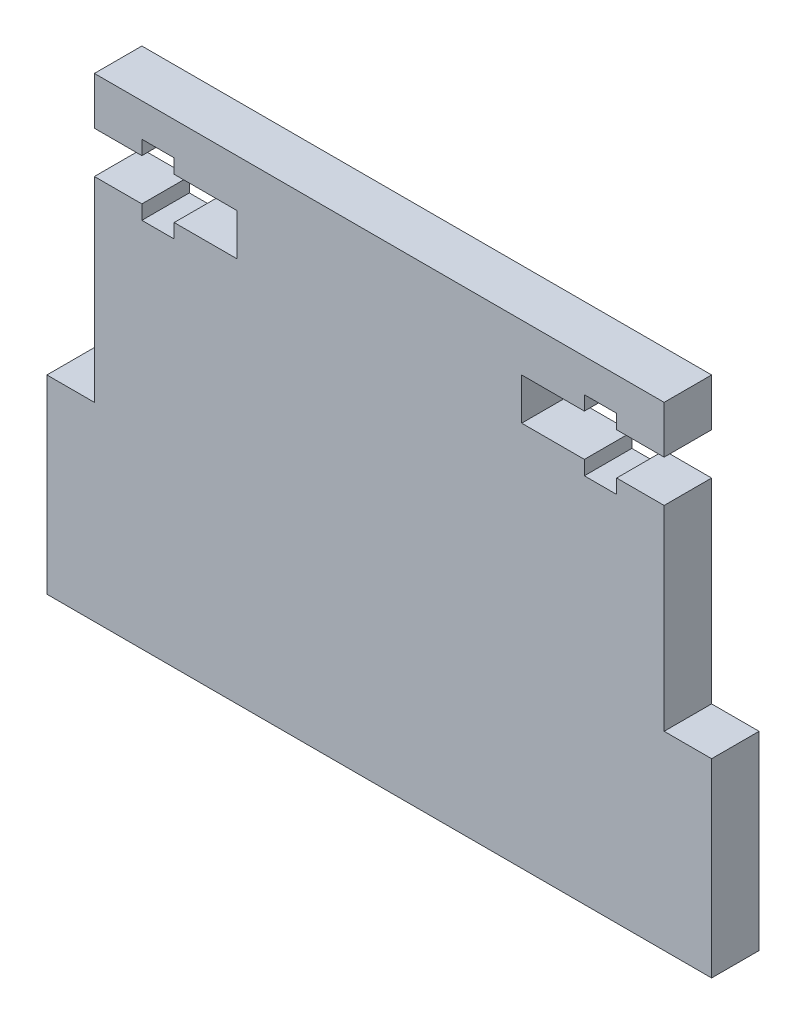
ISO-10303-21;
HEADER;
FILE_DESCRIPTION(('STEP AP214'),'2;1');
FILE_NAME('part.step','',(''),(''),'','','');
FILE_SCHEMA(('AUTOMOTIVE_DESIGN { 1 0 10303 214 1 1 1 1 }'));
ENDSEC;
DATA;
#1=APPLICATION_CONTEXT('core data for automotive mechanical design processes');
#2=APPLICATION_PROTOCOL_DEFINITION('international standard','automotive_design',2000,#1);
#3=PRODUCT_CONTEXT('',#1,'mechanical');
#4=PRODUCT('Part','Part','',(#3));
#5=PRODUCT_RELATED_PRODUCT_CATEGORY('part','',(#4));
#6=PRODUCT_DEFINITION_FORMATION('','',#4);
#7=PRODUCT_DEFINITION_CONTEXT('part definition',#1,'design');
#8=PRODUCT_DEFINITION('design','',#6,#7);
#9=PRODUCT_DEFINITION_SHAPE('','',#8);
#10=(LENGTH_UNIT() NAMED_UNIT(*) SI_UNIT(.MILLI.,.METRE.));
#11=(NAMED_UNIT(*) PLANE_ANGLE_UNIT() SI_UNIT($,.RADIAN.));
#12=(NAMED_UNIT(*) SI_UNIT($,.STERADIAN.) SOLID_ANGLE_UNIT());
#13=UNCERTAINTY_MEASURE_WITH_UNIT(LENGTH_MEASURE(1.E-05),#10,'distance_accuracy_value','');
#14=(GEOMETRIC_REPRESENTATION_CONTEXT(3) GLOBAL_UNCERTAINTY_ASSIGNED_CONTEXT((#13)) GLOBAL_UNIT_ASSIGNED_CONTEXT((#10,
#11,#12)) REPRESENTATION_CONTEXT('',''));
#15=CARTESIAN_POINT('',(0.,0.,0.));
#16=DIRECTION('',(0.,0.,1.));
#17=DIRECTION('',(1.,0.,0.));
#18=AXIS2_PLACEMENT_3D('',#15,#16,#17);
#19=CARTESIAN_POINT('',(-30.,25.,5.));
#20=DIRECTION('',(1.,0.,0.));
#21=DIRECTION('',(0.,1.,0.));
#22=AXIS2_PLACEMENT_3D('',#19,#20,#21);
#23=PLANE('',#22);
#24=DIRECTION('',(0.,-1.,0.));
#25=VECTOR('',#24,1.);
#26=CARTESIAN_POINT('',(-30.,25.,0.));
#27=LINE('',#26,#25);
#28=CARTESIAN_POINT('',(-30.,15.6,0.));
#29=VERTEX_POINT('',#28);
#30=CARTESIAN_POINT('',(-30.,-5.,0.));
#31=VERTEX_POINT('',#30);
#32=EDGE_CURVE('E53',#29,#31,#27,.T.);
#33=ORIENTED_EDGE('',*,*,#32,.T.);
#34=DIRECTION('',(0.,0.,-1.));
#35=VECTOR('',#34,1.);
#36=CARTESIAN_POINT('',(-30.,-5.,5.));
#37=LINE('',#36,#35);
#38=CARTESIAN_POINT('',(-30.,-5.,5.));
#39=VERTEX_POINT('',#38);
#40=EDGE_CURVE('E48',#39,#31,#37,.T.);
#41=ORIENTED_EDGE('',*,*,#40,.F.);
#42=DIRECTION('',(0.,-1.,0.));
#43=VECTOR('',#42,1.);
#44=CARTESIAN_POINT('',(-30.,25.,5.));
#45=LINE('',#44,#43);
#46=CARTESIAN_POINT('',(-30.,15.6,5.));
#47=VERTEX_POINT('',#46);
#48=EDGE_CURVE('E477',#47,#39,#45,.T.);
#49=ORIENTED_EDGE('',*,*,#48,.F.);
#50=DIRECTION('',(0.,0.,1.));
#51=VECTOR('',#50,1.);
#52=CARTESIAN_POINT('',(-30.,15.6,0.));
#53=LINE('',#52,#51);
#54=EDGE_CURVE('E363',#29,#47,#53,.T.);
#55=ORIENTED_EDGE('',*,*,#54,.F.);
#56=EDGE_LOOP('',(#33,#41,#49,#55));
#57=FACE_BOUND('',#56,.T.);
#58=ADVANCED_FACE('F33',(#57),#23,.F.);
#59=CARTESIAN_POINT('',(30.,25.,5.));
#60=DIRECTION('',(-1.,0.,0.));
#61=DIRECTION('',(0.,-1.,0.));
#62=AXIS2_PLACEMENT_3D('',#59,#60,#61);
#63=PLANE('',#62);
#64=DIRECTION('',(0.,1.,0.));
#65=VECTOR('',#64,1.);
#66=CARTESIAN_POINT('',(30.,25.,5.));
#67=LINE('',#66,#65);
#68=CARTESIAN_POINT('',(30.,-5.,5.));
#69=VERTEX_POINT('',#68);
#70=CARTESIAN_POINT('',(30.,15.6,5.));
#71=VERTEX_POINT('',#70);
#72=EDGE_CURVE('E479',#69,#71,#67,.T.);
#73=ORIENTED_EDGE('',*,*,#72,.F.);
#74=DIRECTION('',(0.,0.,-1.));
#75=VECTOR('',#74,1.);
#76=CARTESIAN_POINT('',(30.,-5.,5.));
#77=LINE('',#76,#75);
#78=CARTESIAN_POINT('',(30.,-5.,0.));
#79=VERTEX_POINT('',#78);
#80=EDGE_CURVE('E285',#69,#79,#77,.T.);
#81=ORIENTED_EDGE('',*,*,#80,.T.);
#82=DIRECTION('',(0.,1.,0.));
#83=VECTOR('',#82,1.);
#84=CARTESIAN_POINT('',(30.,25.,0.));
#85=LINE('',#84,#83);
#86=CARTESIAN_POINT('',(30.,15.6,0.));
#87=VERTEX_POINT('',#86);
#88=EDGE_CURVE('E489',#79,#87,#85,.T.);
#89=ORIENTED_EDGE('',*,*,#88,.T.);
#90=DIRECTION('',(0.,0.,1.));
#91=VECTOR('',#90,1.);
#92=CARTESIAN_POINT('',(30.,15.6,0.));
#93=LINE('',#92,#91);
#94=EDGE_CURVE('E335',#87,#71,#93,.T.);
#95=ORIENTED_EDGE('',*,*,#94,.T.);
#96=EDGE_LOOP('',(#73,#81,#89,#95));
#97=FACE_BOUND('',#96,.T.);
#98=ADVANCED_FACE('F560',(#97),#63,.F.);
#99=CARTESIAN_POINT('',(-30.,25.,0.));
#100=VERTEX_POINT('',#99);
#101=CARTESIAN_POINT('',(-30.,20.,0.));
#102=VERTEX_POINT('',#101);
#103=EDGE_CURVE('E483',#100,#102,#27,.T.);
#104=ORIENTED_EDGE('',*,*,#103,.T.);
#105=DIRECTION('',(0.,0.,1.));
#106=VECTOR('',#105,1.);
#107=CARTESIAN_POINT('',(-30.,20.,0.));
#108=LINE('',#107,#106);
#109=CARTESIAN_POINT('',(-30.,20.,5.));
#110=VERTEX_POINT('',#109);
#111=EDGE_CURVE('E365',#102,#110,#108,.T.);
#112=ORIENTED_EDGE('',*,*,#111,.T.);
#113=CARTESIAN_POINT('',(-30.,25.,5.));
#114=VERTEX_POINT('',#113);
#115=EDGE_CURVE('E254',#114,#110,#45,.T.);
#116=ORIENTED_EDGE('',*,*,#115,.F.);
#117=DIRECTION('',(0.,0.,-1.));
#118=VECTOR('',#117,1.);
#119=CARTESIAN_POINT('',(-30.,25.,5.));
#120=LINE('',#119,#118);
#121=EDGE_CURVE('E41',#114,#100,#120,.T.);
#122=ORIENTED_EDGE('',*,*,#121,.T.);
#123=EDGE_LOOP('',(#104,#112,#116,#122));
#124=FACE_BOUND('',#123,.T.);
#125=ADVANCED_FACE('F35',(#124),#23,.F.);
#126=CARTESIAN_POINT('',(-30.,-25.,5.));
#127=DIRECTION('',(0.,1.,0.));
#128=DIRECTION('',(0.,0.,1.));
#129=AXIS2_PLACEMENT_3D('',#126,#127,#128);
#130=PLANE('',#129);
#131=DIRECTION('',(1.,0.,0.));
#132=VECTOR('',#131,1.);
#133=CARTESIAN_POINT('',(-30.,-25.,0.));
#134=LINE('',#133,#132);
#135=CARTESIAN_POINT('',(-35.,-25.,0.));
#136=VERTEX_POINT('',#135);
#137=CARTESIAN_POINT('',(35.,-25.,0.));
#138=VERTEX_POINT('',#137);
#139=EDGE_CURVE('E486',#136,#138,#134,.T.);
#140=ORIENTED_EDGE('',*,*,#139,.T.);
#141=DIRECTION('',(0.,0.,-1.));
#142=VECTOR('',#141,1.);
#143=CARTESIAN_POINT('',(35.,-25.,5.));
#144=LINE('',#143,#142);
#145=CARTESIAN_POINT('',(35.,-25.,5.));
#146=VERTEX_POINT('',#145);
#147=EDGE_CURVE('E248',#146,#138,#144,.T.);
#148=ORIENTED_EDGE('',*,*,#147,.F.);
#149=DIRECTION('',(1.,0.,0.));
#150=VECTOR('',#149,1.);
#151=CARTESIAN_POINT('',(-30.,-25.,5.));
#152=LINE('',#151,#150);
#153=CARTESIAN_POINT('',(-35.,-25.,5.));
#154=VERTEX_POINT('',#153);
#155=EDGE_CURVE('E242',#154,#146,#152,.T.);
#156=ORIENTED_EDGE('',*,*,#155,.F.);
#157=DIRECTION('',(0.,0.,-1.));
#158=VECTOR('',#157,1.);
#159=CARTESIAN_POINT('',(-35.,-25.,5.));
#160=LINE('',#159,#158);
#161=EDGE_CURVE('E245',#154,#136,#160,.T.);
#162=ORIENTED_EDGE('',*,*,#161,.T.);
#163=EDGE_LOOP('',(#140,#148,#156,#162));
#164=FACE_BOUND('',#163,.T.);
#165=ADVANCED_FACE('F244',(#164),#130,.F.);
#166=CARTESIAN_POINT('',(30.,20.,5.));
#167=VERTEX_POINT('',#166);
#168=CARTESIAN_POINT('',(30.,25.,5.));
#169=VERTEX_POINT('',#168);
#170=EDGE_CURVE('E253',#167,#169,#67,.T.);
#171=ORIENTED_EDGE('',*,*,#170,.F.);
#172=DIRECTION('',(0.,0.,1.));
#173=VECTOR('',#172,1.);
#174=CARTESIAN_POINT('',(30.,20.,0.));
#175=LINE('',#174,#173);
#176=CARTESIAN_POINT('',(30.,20.,0.));
#177=VERTEX_POINT('',#176);
#178=EDGE_CURVE('E421',#177,#167,#175,.T.);
#179=ORIENTED_EDGE('',*,*,#178,.F.);
#180=CARTESIAN_POINT('',(30.,25.,0.));
#181=VERTEX_POINT('',#180);
#182=EDGE_CURVE('E488',#177,#181,#85,.T.);
#183=ORIENTED_EDGE('',*,*,#182,.T.);
#184=DIRECTION('',(0.,0.,-1.));
#185=VECTOR('',#184,1.);
#186=CARTESIAN_POINT('',(30.,25.,5.));
#187=LINE('',#186,#185);
#188=EDGE_CURVE('E11',#169,#181,#187,.T.);
#189=ORIENTED_EDGE('',*,*,#188,.F.);
#190=EDGE_LOOP('',(#171,#179,#183,#189));
#191=FACE_BOUND('',#190,.T.);
#192=ADVANCED_FACE('F514',(#191),#63,.F.);
#193=CARTESIAN_POINT('',(-30.,25.,5.));
#194=DIRECTION('',(0.,-1.,0.));
#195=DIRECTION('',(0.,0.,-1.));
#196=AXIS2_PLACEMENT_3D('',#193,#194,#195);
#197=PLANE('',#196);
#198=DIRECTION('',(-1.,0.,0.));
#199=VECTOR('',#198,1.);
#200=CARTESIAN_POINT('',(-30.,25.,0.));
#201=LINE('',#200,#199);
#202=EDGE_CURVE('E491',#181,#100,#201,.T.);
#203=ORIENTED_EDGE('',*,*,#202,.T.);
#204=ORIENTED_EDGE('',*,*,#121,.F.);
#205=DIRECTION('',(-1.,0.,0.));
#206=VECTOR('',#205,1.);
#207=CARTESIAN_POINT('',(-30.,25.,5.));
#208=LINE('',#207,#206);
#209=EDGE_CURVE('E481',#169,#114,#208,.T.);
#210=ORIENTED_EDGE('',*,*,#209,.F.);
#211=ORIENTED_EDGE('',*,*,#188,.T.);
#212=EDGE_LOOP('',(#203,#204,#210,#211));
#213=FACE_BOUND('',#212,.T.);
#214=ADVANCED_FACE('F512',(#213),#197,.F.);
#215=CARTESIAN_POINT('',(0.,0.,5.));
#216=DIRECTION('',(0.,0.,1.));
#217=DIRECTION('',(1.,0.,0.));
#218=AXIS2_PLACEMENT_3D('',#215,#216,#217);
#219=PLANE('',#218);
#220=DIRECTION('',(1.,0.,0.));
#221=VECTOR('',#220,1.);
#222=CARTESIAN_POINT('',(-25.,15.6,5.));
#223=LINE('',#222,#221);
#224=CARTESIAN_POINT('',(-25.,15.6,5.));
#225=VERTEX_POINT('',#224);
#226=EDGE_CURVE('E331',#47,#225,#223,.T.);
#227=ORIENTED_EDGE('',*,*,#226,.F.);
#228=ORIENTED_EDGE('',*,*,#48,.T.);
#229=DIRECTION('',(1.,0.,0.));
#230=VECTOR('',#229,1.);
#231=CARTESIAN_POINT('',(-30.,-5.,5.));
#232=LINE('',#231,#230);
#233=CARTESIAN_POINT('',(-35.,-5.,5.));
#234=VERTEX_POINT('',#233);
#235=EDGE_CURVE('E264',#234,#39,#232,.T.);
#236=ORIENTED_EDGE('',*,*,#235,.F.);
#237=DIRECTION('',(0.,1.,0.));
#238=VECTOR('',#237,1.);
#239=CARTESIAN_POINT('',(-35.,-25.,5.));
#240=LINE('',#239,#238);
#241=EDGE_CURVE('E259',#154,#234,#240,.T.);
#242=ORIENTED_EDGE('',*,*,#241,.F.);
#243=ORIENTED_EDGE('',*,*,#155,.T.);
#244=DIRECTION('',(0.,-1.,0.));
#245=VECTOR('',#244,1.);
#246=CARTESIAN_POINT('',(35.,-25.,5.));
#247=LINE('',#246,#245);
#248=CARTESIAN_POINT('',(35.,-5.,5.));
#249=VERTEX_POINT('',#248);
#250=EDGE_CURVE('E282',#249,#146,#247,.T.);
#251=ORIENTED_EDGE('',*,*,#250,.F.);
#252=DIRECTION('',(1.,0.,0.));
#253=VECTOR('',#252,1.);
#254=CARTESIAN_POINT('',(30.,-5.,5.));
#255=LINE('',#254,#253);
#256=EDGE_CURVE('E279',#69,#249,#255,.T.);
#257=ORIENTED_EDGE('',*,*,#256,.F.);
#258=ORIENTED_EDGE('',*,*,#72,.T.);
#259=DIRECTION('',(1.,0.,0.));
#260=VECTOR('',#259,1.);
#261=CARTESIAN_POINT('',(25.,15.6,5.));
#262=LINE('',#261,#260);
#263=CARTESIAN_POINT('',(25.,15.6,5.));
#264=VERTEX_POINT('',#263);
#265=EDGE_CURVE('E391',#264,#71,#262,.T.);
#266=ORIENTED_EDGE('',*,*,#265,.F.);
#267=DIRECTION('',(0.,1.,0.));
#268=VECTOR('',#267,1.);
#269=CARTESIAN_POINT('',(25.,14.1,5.));
#270=LINE('',#269,#268);
#271=CARTESIAN_POINT('',(25.,14.1,5.));
#272=VERTEX_POINT('',#271);
#273=EDGE_CURVE('E448',#272,#264,#270,.T.);
#274=ORIENTED_EDGE('',*,*,#273,.F.);
#275=DIRECTION('',(1.,0.,0.));
#276=VECTOR('',#275,1.);
#277=CARTESIAN_POINT('',(21.6,14.1,5.));
#278=LINE('',#277,#276);
#279=CARTESIAN_POINT('',(21.6,14.1,5.));
#280=VERTEX_POINT('',#279);
#281=EDGE_CURVE('E445',#280,#272,#278,.T.);
#282=ORIENTED_EDGE('',*,*,#281,.F.);
#283=DIRECTION('',(0.,-1.,0.));
#284=VECTOR('',#283,1.);
#285=CARTESIAN_POINT('',(21.6,15.6,5.));
#286=LINE('',#285,#284);
#287=CARTESIAN_POINT('',(21.6,15.6,5.));
#288=VERTEX_POINT('',#287);
#289=EDGE_CURVE('E442',#288,#280,#286,.T.);
#290=ORIENTED_EDGE('',*,*,#289,.F.);
#291=DIRECTION('',(1.,0.,0.));
#292=VECTOR('',#291,1.);
#293=CARTESIAN_POINT('',(15.,15.6,5.));
#294=LINE('',#293,#292);
#295=CARTESIAN_POINT('',(15.,15.6,5.));
#296=VERTEX_POINT('',#295);
#297=EDGE_CURVE('E439',#296,#288,#294,.T.);
#298=ORIENTED_EDGE('',*,*,#297,.F.);
#299=DIRECTION('',(0.,-1.,0.));
#300=VECTOR('',#299,1.);
#301=CARTESIAN_POINT('',(15.,20.,5.));
#302=LINE('',#301,#300);
#303=CARTESIAN_POINT('',(15.,20.,5.));
#304=VERTEX_POINT('',#303);
#305=EDGE_CURVE('E436',#304,#296,#302,.T.);
#306=ORIENTED_EDGE('',*,*,#305,.F.);
#307=DIRECTION('',(-1.,0.,0.));
#308=VECTOR('',#307,1.);
#309=CARTESIAN_POINT('',(21.6,20.,5.));
#310=LINE('',#309,#308);
#311=CARTESIAN_POINT('',(21.6,20.,5.));
#312=VERTEX_POINT('',#311);
#313=EDGE_CURVE('E433',#312,#304,#310,.T.);
#314=ORIENTED_EDGE('',*,*,#313,.F.);
#315=DIRECTION('',(0.,-1.,0.));
#316=VECTOR('',#315,1.);
#317=CARTESIAN_POINT('',(21.6,21.5,5.));
#318=LINE('',#317,#316);
#319=CARTESIAN_POINT('',(21.6,21.5,5.));
#320=VERTEX_POINT('',#319);
#321=EDGE_CURVE('E430',#320,#312,#318,.T.);
#322=ORIENTED_EDGE('',*,*,#321,.F.);
#323=DIRECTION('',(-1.,0.,0.));
#324=VECTOR('',#323,1.);
#325=CARTESIAN_POINT('',(25.,21.5,5.));
#326=LINE('',#325,#324);
#327=CARTESIAN_POINT('',(25.,21.5,5.));
#328=VERTEX_POINT('',#327);
#329=EDGE_CURVE('E427',#328,#320,#326,.T.);
#330=ORIENTED_EDGE('',*,*,#329,.F.);
#331=DIRECTION('',(0.,1.,0.));
#332=VECTOR('',#331,1.);
#333=CARTESIAN_POINT('',(25.,20.,5.));
#334=LINE('',#333,#332);
#335=CARTESIAN_POINT('',(25.,20.,5.));
#336=VERTEX_POINT('',#335);
#337=EDGE_CURVE('E424',#336,#328,#334,.T.);
#338=ORIENTED_EDGE('',*,*,#337,.F.);
#339=DIRECTION('',(-1.,0.,0.));
#340=VECTOR('',#339,1.);
#341=CARTESIAN_POINT('',(30.,20.,5.));
#342=LINE('',#341,#340);
#343=EDGE_CURVE('E291',#167,#336,#342,.T.);
#344=ORIENTED_EDGE('',*,*,#343,.F.);
#345=ORIENTED_EDGE('',*,*,#170,.T.);
#346=ORIENTED_EDGE('',*,*,#209,.T.);
#347=ORIENTED_EDGE('',*,*,#115,.T.);
#348=DIRECTION('',(-1.,0.,0.));
#349=VECTOR('',#348,1.);
#350=CARTESIAN_POINT('',(-30.,20.,5.));
#351=LINE('',#350,#349);
#352=CARTESIAN_POINT('',(-25.,20.,5.));
#353=VERTEX_POINT('',#352);
#354=EDGE_CURVE('E300',#353,#110,#351,.T.);
#355=ORIENTED_EDGE('',*,*,#354,.F.);
#356=DIRECTION('',(0.,-1.,0.));
#357=VECTOR('',#356,1.);
#358=CARTESIAN_POINT('',(-25.,20.,5.));
#359=LINE('',#358,#357);
#360=CARTESIAN_POINT('',(-25.,21.5,5.));
#361=VERTEX_POINT('',#360);
#362=EDGE_CURVE('E359',#361,#353,#359,.T.);
#363=ORIENTED_EDGE('',*,*,#362,.F.);
#364=DIRECTION('',(-1.,0.,0.));
#365=VECTOR('',#364,1.);
#366=CARTESIAN_POINT('',(-25.,21.5,5.));
#367=LINE('',#366,#365);
#368=CARTESIAN_POINT('',(-21.6,21.5,5.));
#369=VERTEX_POINT('',#368);
#370=EDGE_CURVE('E356',#369,#361,#367,.T.);
#371=ORIENTED_EDGE('',*,*,#370,.F.);
#372=DIRECTION('',(0.,1.,0.));
#373=VECTOR('',#372,1.);
#374=CARTESIAN_POINT('',(-21.6,21.5,5.));
#375=LINE('',#374,#373);
#376=CARTESIAN_POINT('',(-21.6,20.,5.));
#377=VERTEX_POINT('',#376);
#378=EDGE_CURVE('E353',#377,#369,#375,.T.);
#379=ORIENTED_EDGE('',*,*,#378,.F.);
#380=DIRECTION('',(-1.,0.,0.));
#381=VECTOR('',#380,1.);
#382=CARTESIAN_POINT('',(-21.6,20.,5.));
#383=LINE('',#382,#381);
#384=CARTESIAN_POINT('',(-15.,20.,5.));
#385=VERTEX_POINT('',#384);
#386=EDGE_CURVE('E350',#385,#377,#383,.T.);
#387=ORIENTED_EDGE('',*,*,#386,.F.);
#388=DIRECTION('',(0.,1.,0.));
#389=VECTOR('',#388,1.);
#390=CARTESIAN_POINT('',(-15.,20.,5.));
#391=LINE('',#390,#389);
#392=CARTESIAN_POINT('',(-15.,15.6,5.));
#393=VERTEX_POINT('',#392);
#394=EDGE_CURVE('E347',#393,#385,#391,.T.);
#395=ORIENTED_EDGE('',*,*,#394,.F.);
#396=DIRECTION('',(1.,0.,0.));
#397=VECTOR('',#396,1.);
#398=CARTESIAN_POINT('',(-15.,15.6,5.));
#399=LINE('',#398,#397);
#400=CARTESIAN_POINT('',(-21.6,15.6,5.));
#401=VERTEX_POINT('',#400);
#402=EDGE_CURVE('E344',#401,#393,#399,.T.);
#403=ORIENTED_EDGE('',*,*,#402,.F.);
#404=DIRECTION('',(0.,1.,0.));
#405=VECTOR('',#404,1.);
#406=CARTESIAN_POINT('',(-21.6,15.6,5.));
#407=LINE('',#406,#405);
#408=CARTESIAN_POINT('',(-21.6,14.1,5.));
#409=VERTEX_POINT('',#408);
#410=EDGE_CURVE('E341',#409,#401,#407,.T.);
#411=ORIENTED_EDGE('',*,*,#410,.F.);
#412=DIRECTION('',(1.,0.,0.));
#413=VECTOR('',#412,1.);
#414=CARTESIAN_POINT('',(-21.6,14.1,5.));
#415=LINE('',#414,#413);
#416=CARTESIAN_POINT('',(-25.,14.1,5.));
#417=VERTEX_POINT('',#416);
#418=EDGE_CURVE('E338',#417,#409,#415,.T.);
#419=ORIENTED_EDGE('',*,*,#418,.F.);
#420=DIRECTION('',(0.,-1.,0.));
#421=VECTOR('',#420,1.);
#422=CARTESIAN_POINT('',(-25.,14.1,5.));
#423=LINE('',#422,#421);
#424=EDGE_CURVE('E334',#225,#417,#423,.T.);
#425=ORIENTED_EDGE('',*,*,#424,.F.);
#426=EDGE_LOOP('',(#227,#228,#236,#242,#243,#251,#257,#258,#266,#274,#282,#290,#298,#306,#314,
#322,#330,#338,#344,#345,#346,#347,#355,#363,#371,#379,#387,#395,#403,#411,#419,#425));
#427=FACE_BOUND('',#426,.T.);
#428=ADVANCED_FACE('F267',(#427),#219,.T.);
#429=CARTESIAN_POINT('',(0.,0.,0.));
#430=DIRECTION('',(0.,0.,1.));
#431=DIRECTION('',(1.,0.,0.));
#432=AXIS2_PLACEMENT_3D('',#429,#430,#431);
#433=PLANE('',#432);
#434=ORIENTED_EDGE('',*,*,#32,.F.);
#435=DIRECTION('',(1.,0.,0.));
#436=VECTOR('',#435,1.);
#437=CARTESIAN_POINT('',(-25.,15.6,0.));
#438=LINE('',#437,#436);
#439=CARTESIAN_POINT('',(-25.,15.6,0.));
#440=VERTEX_POINT('',#439);
#441=EDGE_CURVE('E296',#29,#440,#438,.T.);
#442=ORIENTED_EDGE('',*,*,#441,.T.);
#443=DIRECTION('',(0.,-1.,0.));
#444=VECTOR('',#443,1.);
#445=CARTESIAN_POINT('',(-25.,14.1,0.));
#446=LINE('',#445,#444);
#447=CARTESIAN_POINT('',(-25.,14.1,0.));
#448=VERTEX_POINT('',#447);
#449=EDGE_CURVE('E299',#440,#448,#446,.T.);
#450=ORIENTED_EDGE('',*,*,#449,.T.);
#451=DIRECTION('',(1.,0.,0.));
#452=VECTOR('',#451,1.);
#453=CARTESIAN_POINT('',(-21.6,14.1,0.));
#454=LINE('',#453,#452);
#455=CARTESIAN_POINT('',(-21.6,14.1,0.));
#456=VERTEX_POINT('',#455);
#457=EDGE_CURVE('E303',#448,#456,#454,.T.);
#458=ORIENTED_EDGE('',*,*,#457,.T.);
#459=DIRECTION('',(0.,1.,0.));
#460=VECTOR('',#459,1.);
#461=CARTESIAN_POINT('',(-21.6,15.6,0.));
#462=LINE('',#461,#460);
#463=CARTESIAN_POINT('',(-21.6,15.6,0.));
#464=VERTEX_POINT('',#463);
#465=EDGE_CURVE('E306',#456,#464,#462,.T.);
#466=ORIENTED_EDGE('',*,*,#465,.T.);
#467=DIRECTION('',(1.,0.,0.));
#468=VECTOR('',#467,1.);
#469=CARTESIAN_POINT('',(-15.,15.6,0.));
#470=LINE('',#469,#468);
#471=CARTESIAN_POINT('',(-15.,15.6,0.));
#472=VERTEX_POINT('',#471);
#473=EDGE_CURVE('E309',#464,#472,#470,.T.);
#474=ORIENTED_EDGE('',*,*,#473,.T.);
#475=DIRECTION('',(0.,1.,0.));
#476=VECTOR('',#475,1.);
#477=CARTESIAN_POINT('',(-15.,20.,0.));
#478=LINE('',#477,#476);
#479=CARTESIAN_POINT('',(-15.,20.,0.));
#480=VERTEX_POINT('',#479);
#481=EDGE_CURVE('E312',#472,#480,#478,.T.);
#482=ORIENTED_EDGE('',*,*,#481,.T.);
#483=DIRECTION('',(-1.,0.,0.));
#484=VECTOR('',#483,1.);
#485=CARTESIAN_POINT('',(-21.6,20.,0.));
#486=LINE('',#485,#484);
#487=CARTESIAN_POINT('',(-21.6,20.,0.));
#488=VERTEX_POINT('',#487);
#489=EDGE_CURVE('E315',#480,#488,#486,.T.);
#490=ORIENTED_EDGE('',*,*,#489,.T.);
#491=DIRECTION('',(0.,1.,0.));
#492=VECTOR('',#491,1.);
#493=CARTESIAN_POINT('',(-21.6,21.5,0.));
#494=LINE('',#493,#492);
#495=CARTESIAN_POINT('',(-21.6,21.5,0.));
#496=VERTEX_POINT('',#495);
#497=EDGE_CURVE('E318',#488,#496,#494,.T.);
#498=ORIENTED_EDGE('',*,*,#497,.T.);
#499=DIRECTION('',(-1.,0.,0.));
#500=VECTOR('',#499,1.);
#501=CARTESIAN_POINT('',(-25.,21.5,0.));
#502=LINE('',#501,#500);
#503=CARTESIAN_POINT('',(-25.,21.5,0.));
#504=VERTEX_POINT('',#503);
#505=EDGE_CURVE('E321',#496,#504,#502,.T.);
#506=ORIENTED_EDGE('',*,*,#505,.T.);
#507=DIRECTION('',(0.,-1.,0.));
#508=VECTOR('',#507,1.);
#509=CARTESIAN_POINT('',(-25.,20.,0.));
#510=LINE('',#509,#508);
#511=CARTESIAN_POINT('',(-25.,20.,0.));
#512=VERTEX_POINT('',#511);
#513=EDGE_CURVE('E324',#504,#512,#510,.T.);
#514=ORIENTED_EDGE('',*,*,#513,.T.);
#515=DIRECTION('',(-1.,0.,0.));
#516=VECTOR('',#515,1.);
#517=CARTESIAN_POINT('',(-30.,20.,0.));
#518=LINE('',#517,#516);
#519=EDGE_CURVE('E327',#512,#102,#518,.T.);
#520=ORIENTED_EDGE('',*,*,#519,.T.);
#521=ORIENTED_EDGE('',*,*,#103,.F.);
#522=ORIENTED_EDGE('',*,*,#202,.F.);
#523=ORIENTED_EDGE('',*,*,#182,.F.);
#524=DIRECTION('',(-1.,0.,0.));
#525=VECTOR('',#524,1.);
#526=CARTESIAN_POINT('',(30.,20.,0.));
#527=LINE('',#526,#525);
#528=CARTESIAN_POINT('',(25.,20.,0.));
#529=VERTEX_POINT('',#528);
#530=EDGE_CURVE('E387',#177,#529,#527,.T.);
#531=ORIENTED_EDGE('',*,*,#530,.T.);
#532=DIRECTION('',(0.,1.,0.));
#533=VECTOR('',#532,1.);
#534=CARTESIAN_POINT('',(25.,20.,0.));
#535=LINE('',#534,#533);
#536=CARTESIAN_POINT('',(25.,21.5,0.));
#537=VERTEX_POINT('',#536);
#538=EDGE_CURVE('E390',#529,#537,#535,.T.);
#539=ORIENTED_EDGE('',*,*,#538,.T.);
#540=DIRECTION('',(-1.,0.,0.));
#541=VECTOR('',#540,1.);
#542=CARTESIAN_POINT('',(25.,21.5,0.));
#543=LINE('',#542,#541);
#544=CARTESIAN_POINT('',(21.6,21.5,0.));
#545=VERTEX_POINT('',#544);
#546=EDGE_CURVE('E394',#537,#545,#543,.T.);
#547=ORIENTED_EDGE('',*,*,#546,.T.);
#548=DIRECTION('',(0.,-1.,0.));
#549=VECTOR('',#548,1.);
#550=CARTESIAN_POINT('',(21.6,21.5,0.));
#551=LINE('',#550,#549);
#552=CARTESIAN_POINT('',(21.6,20.,0.));
#553=VERTEX_POINT('',#552);
#554=EDGE_CURVE('E397',#545,#553,#551,.T.);
#555=ORIENTED_EDGE('',*,*,#554,.T.);
#556=DIRECTION('',(-1.,0.,0.));
#557=VECTOR('',#556,1.);
#558=CARTESIAN_POINT('',(21.6,20.,0.));
#559=LINE('',#558,#557);
#560=CARTESIAN_POINT('',(15.,20.,0.));
#561=VERTEX_POINT('',#560);
#562=EDGE_CURVE('E400',#553,#561,#559,.T.);
#563=ORIENTED_EDGE('',*,*,#562,.T.);
#564=DIRECTION('',(0.,-1.,0.));
#565=VECTOR('',#564,1.);
#566=CARTESIAN_POINT('',(15.,20.,0.));
#567=LINE('',#566,#565);
#568=CARTESIAN_POINT('',(15.,15.6,0.));
#569=VERTEX_POINT('',#568);
#570=EDGE_CURVE('E403',#561,#569,#567,.T.);
#571=ORIENTED_EDGE('',*,*,#570,.T.);
#572=DIRECTION('',(1.,0.,0.));
#573=VECTOR('',#572,1.);
#574=CARTESIAN_POINT('',(15.,15.6,0.));
#575=LINE('',#574,#573);
#576=CARTESIAN_POINT('',(21.6,15.6,0.));
#577=VERTEX_POINT('',#576);
#578=EDGE_CURVE('E406',#569,#577,#575,.T.);
#579=ORIENTED_EDGE('',*,*,#578,.T.);
#580=DIRECTION('',(0.,-1.,0.));
#581=VECTOR('',#580,1.);
#582=CARTESIAN_POINT('',(21.6,15.6,0.));
#583=LINE('',#582,#581);
#584=CARTESIAN_POINT('',(21.6,14.1,0.));
#585=VERTEX_POINT('',#584);
#586=EDGE_CURVE('E409',#577,#585,#583,.T.);
#587=ORIENTED_EDGE('',*,*,#586,.T.);
#588=DIRECTION('',(1.,0.,0.));
#589=VECTOR('',#588,1.);
#590=CARTESIAN_POINT('',(21.6,14.1,0.));
#591=LINE('',#590,#589);
#592=CARTESIAN_POINT('',(25.,14.1,0.));
#593=VERTEX_POINT('',#592);
#594=EDGE_CURVE('E412',#585,#593,#591,.T.);
#595=ORIENTED_EDGE('',*,*,#594,.T.);
#596=DIRECTION('',(0.,1.,0.));
#597=VECTOR('',#596,1.);
#598=CARTESIAN_POINT('',(25.,14.1,0.));
#599=LINE('',#598,#597);
#600=CARTESIAN_POINT('',(25.,15.6,0.));
#601=VERTEX_POINT('',#600);
#602=EDGE_CURVE('E415',#593,#601,#599,.T.);
#603=ORIENTED_EDGE('',*,*,#602,.T.);
#604=DIRECTION('',(1.,0.,0.));
#605=VECTOR('',#604,1.);
#606=CARTESIAN_POINT('',(25.,15.6,0.));
#607=LINE('',#606,#605);
#608=EDGE_CURVE('E418',#601,#87,#607,.T.);
#609=ORIENTED_EDGE('',*,*,#608,.T.);
#610=ORIENTED_EDGE('',*,*,#88,.F.);
#611=DIRECTION('',(1.,0.,0.));
#612=VECTOR('',#611,1.);
#613=CARTESIAN_POINT('',(30.,-5.,0.));
#614=LINE('',#613,#612);
#615=CARTESIAN_POINT('',(35.,-5.,0.));
#616=VERTEX_POINT('',#615);
#617=EDGE_CURVE('E277',#79,#616,#614,.T.);
#618=ORIENTED_EDGE('',*,*,#617,.T.);
#619=DIRECTION('',(0.,-1.,0.));
#620=VECTOR('',#619,1.);
#621=CARTESIAN_POINT('',(35.,-25.,0.));
#622=LINE('',#621,#620);
#623=EDGE_CURVE('E283',#616,#138,#622,.T.);
#624=ORIENTED_EDGE('',*,*,#623,.T.);
#625=ORIENTED_EDGE('',*,*,#139,.F.);
#626=DIRECTION('',(0.,1.,0.));
#627=VECTOR('',#626,1.);
#628=CARTESIAN_POINT('',(-35.,-25.,0.));
#629=LINE('',#628,#627);
#630=CARTESIAN_POINT('',(-35.,-5.,0.));
#631=VERTEX_POINT('',#630);
#632=EDGE_CURVE('E262',#136,#631,#629,.T.);
#633=ORIENTED_EDGE('',*,*,#632,.T.);
#634=DIRECTION('',(1.,0.,0.));
#635=VECTOR('',#634,1.);
#636=CARTESIAN_POINT('',(-30.,-5.,0.));
#637=LINE('',#636,#635);
#638=EDGE_CURVE('E269',#631,#31,#637,.T.);
#639=ORIENTED_EDGE('',*,*,#638,.T.);
#640=EDGE_LOOP('',(#434,#442,#450,#458,#466,#474,#482,#490,#498,#506,#514,#520,#521,#522,#523,
#531,#539,#547,#555,#563,#571,#579,#587,#595,#603,#609,#610,#618,#624,#625,#633,#639));
#641=FACE_BOUND('',#640,.T.);
#642=ADVANCED_FACE('F501',(#641),#433,.F.);
#643=CARTESIAN_POINT('',(25.,15.6,0.));
#644=DIRECTION('',(0.,-1.,0.));
#645=DIRECTION('',(1.,0.,0.));
#646=AXIS2_PLACEMENT_3D('',#643,#644,#645);
#647=PLANE('',#646);
#648=ORIENTED_EDGE('',*,*,#265,.T.);
#649=ORIENTED_EDGE('',*,*,#94,.F.);
#650=ORIENTED_EDGE('',*,*,#608,.F.);
#651=DIRECTION('',(0.,0.,1.));
#652=VECTOR('',#651,1.);
#653=CARTESIAN_POINT('',(25.,15.6,0.));
#654=LINE('',#653,#652);
#655=EDGE_CURVE('E455',#601,#264,#654,.T.);
#656=ORIENTED_EDGE('',*,*,#655,.T.);
#657=EDGE_LOOP('',(#648,#649,#650,#656));
#658=FACE_BOUND('',#657,.T.);
#659=ADVANCED_FACE('F558',(#658),#647,.F.);
#660=CARTESIAN_POINT('',(25.,14.1,0.));
#661=DIRECTION('',(1.,0.,0.));
#662=DIRECTION('',(0.,0.,-1.));
#663=AXIS2_PLACEMENT_3D('',#660,#661,#662);
#664=PLANE('',#663);
#665=ORIENTED_EDGE('',*,*,#273,.T.);
#666=ORIENTED_EDGE('',*,*,#655,.F.);
#667=ORIENTED_EDGE('',*,*,#602,.F.);
#668=DIRECTION('',(0.,0.,1.));
#669=VECTOR('',#668,1.);
#670=CARTESIAN_POINT('',(25.,14.1,0.));
#671=LINE('',#670,#669);
#672=EDGE_CURVE('E457',#593,#272,#671,.T.);
#673=ORIENTED_EDGE('',*,*,#672,.T.);
#674=EDGE_LOOP('',(#665,#666,#667,#673));
#675=FACE_BOUND('',#674,.T.);
#676=ADVANCED_FACE('F553',(#675),#664,.F.);
#677=CARTESIAN_POINT('',(21.6,14.1,0.));
#678=DIRECTION('',(0.,-1.,0.));
#679=DIRECTION('',(0.,0.,-1.));
#680=AXIS2_PLACEMENT_3D('',#677,#678,#679);
#681=PLANE('',#680);
#682=ORIENTED_EDGE('',*,*,#281,.T.);
#683=ORIENTED_EDGE('',*,*,#672,.F.);
#684=ORIENTED_EDGE('',*,*,#594,.F.);
#685=DIRECTION('',(0.,0.,1.));
#686=VECTOR('',#685,1.);
#687=CARTESIAN_POINT('',(21.6,14.1,0.));
#688=LINE('',#687,#686);
#689=EDGE_CURVE('E459',#585,#280,#688,.T.);
#690=ORIENTED_EDGE('',*,*,#689,.T.);
#691=EDGE_LOOP('',(#682,#683,#684,#690));
#692=FACE_BOUND('',#691,.T.);
#693=ADVANCED_FACE('F549',(#692),#681,.F.);
#694=CARTESIAN_POINT('',(21.6,15.6,0.));
#695=DIRECTION('',(-1.,0.,0.));
#696=DIRECTION('',(0.,0.,1.));
#697=AXIS2_PLACEMENT_3D('',#694,#695,#696);
#698=PLANE('',#697);
#699=ORIENTED_EDGE('',*,*,#289,.T.);
#700=ORIENTED_EDGE('',*,*,#689,.F.);
#701=ORIENTED_EDGE('',*,*,#586,.F.);
#702=DIRECTION('',(0.,0.,1.));
#703=VECTOR('',#702,1.);
#704=CARTESIAN_POINT('',(21.6,15.6,0.));
#705=LINE('',#704,#703);
#706=EDGE_CURVE('E461',#577,#288,#705,.T.);
#707=ORIENTED_EDGE('',*,*,#706,.T.);
#708=EDGE_LOOP('',(#699,#700,#701,#707));
#709=FACE_BOUND('',#708,.T.);
#710=ADVANCED_FACE('F545',(#709),#698,.F.);
#711=CARTESIAN_POINT('',(15.,15.6,0.));
#712=DIRECTION('',(0.,-1.,0.));
#713=DIRECTION('',(0.,0.,-1.));
#714=AXIS2_PLACEMENT_3D('',#711,#712,#713);
#715=PLANE('',#714);
#716=ORIENTED_EDGE('',*,*,#297,.T.);
#717=ORIENTED_EDGE('',*,*,#706,.F.);
#718=ORIENTED_EDGE('',*,*,#578,.F.);
#719=DIRECTION('',(0.,0.,1.));
#720=VECTOR('',#719,1.);
#721=CARTESIAN_POINT('',(15.,15.6,0.));
#722=LINE('',#721,#720);
#723=EDGE_CURVE('E463',#569,#296,#722,.T.);
#724=ORIENTED_EDGE('',*,*,#723,.T.);
#725=EDGE_LOOP('',(#716,#717,#718,#724));
#726=FACE_BOUND('',#725,.T.);
#727=ADVANCED_FACE('F541',(#726),#715,.F.);
#728=CARTESIAN_POINT('',(15.,20.,0.));
#729=DIRECTION('',(-1.,0.,0.));
#730=DIRECTION('',(0.,0.,1.));
#731=AXIS2_PLACEMENT_3D('',#728,#729,#730);
#732=PLANE('',#731);
#733=ORIENTED_EDGE('',*,*,#305,.T.);
#734=ORIENTED_EDGE('',*,*,#723,.F.);
#735=ORIENTED_EDGE('',*,*,#570,.F.);
#736=DIRECTION('',(0.,0.,1.));
#737=VECTOR('',#736,1.);
#738=CARTESIAN_POINT('',(15.,20.,0.));
#739=LINE('',#738,#737);
#740=EDGE_CURVE('E465',#561,#304,#739,.T.);
#741=ORIENTED_EDGE('',*,*,#740,.T.);
#742=EDGE_LOOP('',(#733,#734,#735,#741));
#743=FACE_BOUND('',#742,.T.);
#744=ADVANCED_FACE('F537',(#743),#732,.F.);
#745=CARTESIAN_POINT('',(21.6,20.,0.));
#746=DIRECTION('',(0.,1.,0.));
#747=DIRECTION('',(0.,0.,1.));
#748=AXIS2_PLACEMENT_3D('',#745,#746,#747);
#749=PLANE('',#748);
#750=ORIENTED_EDGE('',*,*,#313,.T.);
#751=ORIENTED_EDGE('',*,*,#740,.F.);
#752=ORIENTED_EDGE('',*,*,#562,.F.);
#753=DIRECTION('',(0.,0.,1.));
#754=VECTOR('',#753,1.);
#755=CARTESIAN_POINT('',(21.6,20.,0.));
#756=LINE('',#755,#754);
#757=EDGE_CURVE('E467',#553,#312,#756,.T.);
#758=ORIENTED_EDGE('',*,*,#757,.T.);
#759=EDGE_LOOP('',(#750,#751,#752,#758));
#760=FACE_BOUND('',#759,.T.);
#761=ADVANCED_FACE('F533',(#760),#749,.F.);
#762=CARTESIAN_POINT('',(21.6,21.5,0.));
#763=DIRECTION('',(-1.,0.,0.));
#764=DIRECTION('',(0.,0.,1.));
#765=AXIS2_PLACEMENT_3D('',#762,#763,#764);
#766=PLANE('',#765);
#767=ORIENTED_EDGE('',*,*,#321,.T.);
#768=ORIENTED_EDGE('',*,*,#757,.F.);
#769=ORIENTED_EDGE('',*,*,#554,.F.);
#770=DIRECTION('',(0.,0.,1.));
#771=VECTOR('',#770,1.);
#772=CARTESIAN_POINT('',(21.6,21.5,0.));
#773=LINE('',#772,#771);
#774=EDGE_CURVE('E469',#545,#320,#773,.T.);
#775=ORIENTED_EDGE('',*,*,#774,.T.);
#776=EDGE_LOOP('',(#767,#768,#769,#775));
#777=FACE_BOUND('',#776,.T.);
#778=ADVANCED_FACE('F529',(#777),#766,.F.);
#779=CARTESIAN_POINT('',(25.,21.5,0.));
#780=DIRECTION('',(0.,1.,0.));
#781=DIRECTION('',(0.,0.,1.));
#782=AXIS2_PLACEMENT_3D('',#779,#780,#781);
#783=PLANE('',#782);
#784=ORIENTED_EDGE('',*,*,#329,.T.);
#785=ORIENTED_EDGE('',*,*,#774,.F.);
#786=ORIENTED_EDGE('',*,*,#546,.F.);
#787=DIRECTION('',(0.,0.,1.));
#788=VECTOR('',#787,1.);
#789=CARTESIAN_POINT('',(25.,21.5,0.));
#790=LINE('',#789,#788);
#791=EDGE_CURVE('E471',#537,#328,#790,.T.);
#792=ORIENTED_EDGE('',*,*,#791,.T.);
#793=EDGE_LOOP('',(#784,#785,#786,#792));
#794=FACE_BOUND('',#793,.T.);
#795=ADVANCED_FACE('F525',(#794),#783,.F.);
#796=CARTESIAN_POINT('',(25.,20.,0.));
#797=DIRECTION('',(1.,0.,0.));
#798=DIRECTION('',(0.,0.,-1.));
#799=AXIS2_PLACEMENT_3D('',#796,#797,#798);
#800=PLANE('',#799);
#801=ORIENTED_EDGE('',*,*,#337,.T.);
#802=ORIENTED_EDGE('',*,*,#791,.F.);
#803=ORIENTED_EDGE('',*,*,#538,.F.);
#804=DIRECTION('',(0.,0.,1.));
#805=VECTOR('',#804,1.);
#806=CARTESIAN_POINT('',(25.,20.,0.));
#807=LINE('',#806,#805);
#808=EDGE_CURVE('E473',#529,#336,#807,.T.);
#809=ORIENTED_EDGE('',*,*,#808,.T.);
#810=EDGE_LOOP('',(#801,#802,#803,#809));
#811=FACE_BOUND('',#810,.T.);
#812=ADVANCED_FACE('F521',(#811),#800,.F.);
#813=CARTESIAN_POINT('',(30.,20.,0.));
#814=DIRECTION('',(0.,1.,0.));
#815=DIRECTION('',(-1.,0.,0.));
#816=AXIS2_PLACEMENT_3D('',#813,#814,#815);
#817=PLANE('',#816);
#818=ORIENTED_EDGE('',*,*,#343,.T.);
#819=ORIENTED_EDGE('',*,*,#808,.F.);
#820=ORIENTED_EDGE('',*,*,#530,.F.);
#821=ORIENTED_EDGE('',*,*,#178,.T.);
#822=EDGE_LOOP('',(#818,#819,#820,#821));
#823=FACE_BOUND('',#822,.T.);
#824=ADVANCED_FACE('F518',(#823),#817,.F.);
#825=CARTESIAN_POINT('',(-25.,15.6,0.));
#826=DIRECTION('',(0.,-1.,0.));
#827=DIRECTION('',(1.,0.,0.));
#828=AXIS2_PLACEMENT_3D('',#825,#826,#827);
#829=PLANE('',#828);
#830=ORIENTED_EDGE('',*,*,#226,.T.);
#831=DIRECTION('',(0.,0.,1.));
#832=VECTOR('',#831,1.);
#833=CARTESIAN_POINT('',(-25.,15.6,0.));
#834=LINE('',#833,#832);
#835=EDGE_CURVE('E330',#440,#225,#834,.T.);
#836=ORIENTED_EDGE('',*,*,#835,.F.);
#837=ORIENTED_EDGE('',*,*,#441,.F.);
#838=ORIENTED_EDGE('',*,*,#54,.T.);
#839=EDGE_LOOP('',(#830,#836,#837,#838));
#840=FACE_BOUND('',#839,.T.);
#841=ADVANCED_FACE('F606',(#840),#829,.F.);
#842=CARTESIAN_POINT('',(-30.,20.,0.));
#843=DIRECTION('',(0.,1.,0.));
#844=DIRECTION('',(-1.,0.,0.));
#845=AXIS2_PLACEMENT_3D('',#842,#843,#844);
#846=PLANE('',#845);
#847=ORIENTED_EDGE('',*,*,#354,.T.);
#848=ORIENTED_EDGE('',*,*,#111,.F.);
#849=ORIENTED_EDGE('',*,*,#519,.F.);
#850=DIRECTION('',(0.,0.,1.));
#851=VECTOR('',#850,1.);
#852=CARTESIAN_POINT('',(-25.,20.,0.));
#853=LINE('',#852,#851);
#854=EDGE_CURVE('E368',#512,#353,#853,.T.);
#855=ORIENTED_EDGE('',*,*,#854,.T.);
#856=EDGE_LOOP('',(#847,#848,#849,#855));
#857=FACE_BOUND('',#856,.T.);
#858=ADVANCED_FACE('F506',(#857),#846,.F.);
#859=CARTESIAN_POINT('',(-25.,20.,0.));
#860=DIRECTION('',(-1.,0.,0.));
#861=DIRECTION('',(0.,0.,1.));
#862=AXIS2_PLACEMENT_3D('',#859,#860,#861);
#863=PLANE('',#862);
#864=ORIENTED_EDGE('',*,*,#362,.T.);
#865=ORIENTED_EDGE('',*,*,#854,.F.);
#866=ORIENTED_EDGE('',*,*,#513,.F.);
#867=DIRECTION('',(0.,0.,1.));
#868=VECTOR('',#867,1.);
#869=CARTESIAN_POINT('',(-25.,21.5,0.));
#870=LINE('',#869,#868);
#871=EDGE_CURVE('E370',#504,#361,#870,.T.);
#872=ORIENTED_EDGE('',*,*,#871,.T.);
#873=EDGE_LOOP('',(#864,#865,#866,#872));
#874=FACE_BOUND('',#873,.T.);
#875=ADVANCED_FACE('F656',(#874),#863,.F.);
#876=CARTESIAN_POINT('',(-25.,21.5,0.));
#877=DIRECTION('',(0.,1.,0.));
#878=DIRECTION('',(0.,0.,1.));
#879=AXIS2_PLACEMENT_3D('',#876,#877,#878);
#880=PLANE('',#879);
#881=ORIENTED_EDGE('',*,*,#370,.T.);
#882=ORIENTED_EDGE('',*,*,#871,.F.);
#883=ORIENTED_EDGE('',*,*,#505,.F.);
#884=DIRECTION('',(0.,0.,1.));
#885=VECTOR('',#884,1.);
#886=CARTESIAN_POINT('',(-21.6,21.5,0.));
#887=LINE('',#886,#885);
#888=EDGE_CURVE('E372',#496,#369,#887,.T.);
#889=ORIENTED_EDGE('',*,*,#888,.T.);
#890=EDGE_LOOP('',(#881,#882,#883,#889));
#891=FACE_BOUND('',#890,.T.);
#892=ADVANCED_FACE('F652',(#891),#880,.F.);
#893=CARTESIAN_POINT('',(-21.6,21.5,0.));
#894=DIRECTION('',(1.,0.,0.));
#895=DIRECTION('',(0.,0.,-1.));
#896=AXIS2_PLACEMENT_3D('',#893,#894,#895);
#897=PLANE('',#896);
#898=ORIENTED_EDGE('',*,*,#378,.T.);
#899=ORIENTED_EDGE('',*,*,#888,.F.);
#900=ORIENTED_EDGE('',*,*,#497,.F.);
#901=DIRECTION('',(0.,0.,1.));
#902=VECTOR('',#901,1.);
#903=CARTESIAN_POINT('',(-21.6,20.,0.));
#904=LINE('',#903,#902);
#905=EDGE_CURVE('E374',#488,#377,#904,.T.);
#906=ORIENTED_EDGE('',*,*,#905,.T.);
#907=EDGE_LOOP('',(#898,#899,#900,#906));
#908=FACE_BOUND('',#907,.T.);
#909=ADVANCED_FACE('F648',(#908),#897,.F.);
#910=CARTESIAN_POINT('',(-21.6,20.,0.));
#911=DIRECTION('',(0.,1.,0.));
#912=DIRECTION('',(0.,0.,1.));
#913=AXIS2_PLACEMENT_3D('',#910,#911,#912);
#914=PLANE('',#913);
#915=ORIENTED_EDGE('',*,*,#386,.T.);
#916=ORIENTED_EDGE('',*,*,#905,.F.);
#917=ORIENTED_EDGE('',*,*,#489,.F.);
#918=DIRECTION('',(0.,0.,1.));
#919=VECTOR('',#918,1.);
#920=CARTESIAN_POINT('',(-15.,20.,0.));
#921=LINE('',#920,#919);
#922=EDGE_CURVE('E376',#480,#385,#921,.T.);
#923=ORIENTED_EDGE('',*,*,#922,.T.);
#924=EDGE_LOOP('',(#915,#916,#917,#923));
#925=FACE_BOUND('',#924,.T.);
#926=ADVANCED_FACE('F644',(#925),#914,.F.);
#927=CARTESIAN_POINT('',(-15.,20.,0.));
#928=DIRECTION('',(1.,0.,0.));
#929=DIRECTION('',(0.,0.,-1.));
#930=AXIS2_PLACEMENT_3D('',#927,#928,#929);
#931=PLANE('',#930);
#932=ORIENTED_EDGE('',*,*,#394,.T.);
#933=ORIENTED_EDGE('',*,*,#922,.F.);
#934=ORIENTED_EDGE('',*,*,#481,.F.);
#935=DIRECTION('',(0.,0.,1.));
#936=VECTOR('',#935,1.);
#937=CARTESIAN_POINT('',(-15.,15.6,0.));
#938=LINE('',#937,#936);
#939=EDGE_CURVE('E378',#472,#393,#938,.T.);
#940=ORIENTED_EDGE('',*,*,#939,.T.);
#941=EDGE_LOOP('',(#932,#933,#934,#940));
#942=FACE_BOUND('',#941,.T.);
#943=ADVANCED_FACE('F640',(#942),#931,.F.);
#944=CARTESIAN_POINT('',(-15.,15.6,0.));
#945=DIRECTION('',(0.,-1.,0.));
#946=DIRECTION('',(0.,0.,-1.));
#947=AXIS2_PLACEMENT_3D('',#944,#945,#946);
#948=PLANE('',#947);
#949=ORIENTED_EDGE('',*,*,#402,.T.);
#950=ORIENTED_EDGE('',*,*,#939,.F.);
#951=ORIENTED_EDGE('',*,*,#473,.F.);
#952=DIRECTION('',(0.,0.,1.));
#953=VECTOR('',#952,1.);
#954=CARTESIAN_POINT('',(-21.6,15.6,0.));
#955=LINE('',#954,#953);
#956=EDGE_CURVE('E380',#464,#401,#955,.T.);
#957=ORIENTED_EDGE('',*,*,#956,.T.);
#958=EDGE_LOOP('',(#949,#950,#951,#957));
#959=FACE_BOUND('',#958,.T.);
#960=ADVANCED_FACE('F636',(#959),#948,.F.);
#961=CARTESIAN_POINT('',(-21.6,15.6,0.));
#962=DIRECTION('',(1.,0.,0.));
#963=DIRECTION('',(0.,0.,-1.));
#964=AXIS2_PLACEMENT_3D('',#961,#962,#963);
#965=PLANE('',#964);
#966=ORIENTED_EDGE('',*,*,#410,.T.);
#967=ORIENTED_EDGE('',*,*,#956,.F.);
#968=ORIENTED_EDGE('',*,*,#465,.F.);
#969=DIRECTION('',(0.,0.,1.));
#970=VECTOR('',#969,1.);
#971=CARTESIAN_POINT('',(-21.6,14.1,0.));
#972=LINE('',#971,#970);
#973=EDGE_CURVE('E382',#456,#409,#972,.T.);
#974=ORIENTED_EDGE('',*,*,#973,.T.);
#975=EDGE_LOOP('',(#966,#967,#968,#974));
#976=FACE_BOUND('',#975,.T.);
#977=ADVANCED_FACE('F632',(#976),#965,.F.);
#978=CARTESIAN_POINT('',(-21.6,14.1,0.));
#979=DIRECTION('',(0.,-1.,0.));
#980=DIRECTION('',(0.,0.,-1.));
#981=AXIS2_PLACEMENT_3D('',#978,#979,#980);
#982=PLANE('',#981);
#983=ORIENTED_EDGE('',*,*,#418,.T.);
#984=ORIENTED_EDGE('',*,*,#973,.F.);
#985=ORIENTED_EDGE('',*,*,#457,.F.);
#986=DIRECTION('',(0.,0.,1.));
#987=VECTOR('',#986,1.);
#988=CARTESIAN_POINT('',(-25.,14.1,0.));
#989=LINE('',#988,#987);
#990=EDGE_CURVE('E384',#448,#417,#989,.T.);
#991=ORIENTED_EDGE('',*,*,#990,.T.);
#992=EDGE_LOOP('',(#983,#984,#985,#991));
#993=FACE_BOUND('',#992,.T.);
#994=ADVANCED_FACE('F578',(#993),#982,.F.);
#995=CARTESIAN_POINT('',(-25.,14.1,0.));
#996=DIRECTION('',(-1.,0.,0.));
#997=DIRECTION('',(0.,0.,1.));
#998=AXIS2_PLACEMENT_3D('',#995,#996,#997);
#999=PLANE('',#998);
#1000=ORIENTED_EDGE('',*,*,#424,.T.);
#1001=ORIENTED_EDGE('',*,*,#990,.F.);
#1002=ORIENTED_EDGE('',*,*,#449,.F.);
#1003=ORIENTED_EDGE('',*,*,#835,.T.);
#1004=EDGE_LOOP('',(#1000,#1001,#1002,#1003));
#1005=FACE_BOUND('',#1004,.T.);
#1006=ADVANCED_FACE('F570',(#1005),#999,.F.);
#1007=CARTESIAN_POINT('',(35.,-25.,5.));
#1008=DIRECTION('',(1.,0.,0.));
#1009=DIRECTION('',(0.,0.,-1.));
#1010=AXIS2_PLACEMENT_3D('',#1007,#1008,#1009);
#1011=PLANE('',#1010);
#1012=ORIENTED_EDGE('',*,*,#623,.F.);
#1013=DIRECTION('',(0.,0.,-1.));
#1014=VECTOR('',#1013,1.);
#1015=CARTESIAN_POINT('',(35.,-5.,5.));
#1016=LINE('',#1015,#1014);
#1017=EDGE_CURVE('E292',#249,#616,#1016,.T.);
#1018=ORIENTED_EDGE('',*,*,#1017,.F.);
#1019=ORIENTED_EDGE('',*,*,#250,.T.);
#1020=ORIENTED_EDGE('',*,*,#147,.T.);
#1021=EDGE_LOOP('',(#1012,#1018,#1019,#1020));
#1022=FACE_BOUND('',#1021,.T.);
#1023=ADVANCED_FACE('F568',(#1022),#1011,.T.);
#1024=CARTESIAN_POINT('',(30.,-5.,5.));
#1025=DIRECTION('',(0.,1.,0.));
#1026=DIRECTION('',(-1.,0.,0.));
#1027=AXIS2_PLACEMENT_3D('',#1024,#1025,#1026);
#1028=PLANE('',#1027);
#1029=ORIENTED_EDGE('',*,*,#617,.F.);
#1030=ORIENTED_EDGE('',*,*,#80,.F.);
#1031=ORIENTED_EDGE('',*,*,#256,.T.);
#1032=ORIENTED_EDGE('',*,*,#1017,.T.);
#1033=EDGE_LOOP('',(#1029,#1030,#1031,#1032));
#1034=FACE_BOUND('',#1033,.T.);
#1035=ADVANCED_FACE('F565',(#1034),#1028,.T.);
#1036=CARTESIAN_POINT('',(-30.,-5.,5.));
#1037=DIRECTION('',(0.,1.,0.));
#1038=DIRECTION('',(0.,0.,1.));
#1039=AXIS2_PLACEMENT_3D('',#1036,#1037,#1038);
#1040=PLANE('',#1039);
#1041=ORIENTED_EDGE('',*,*,#638,.F.);
#1042=DIRECTION('',(0.,0.,-1.));
#1043=VECTOR('',#1042,1.);
#1044=CARTESIAN_POINT('',(-35.,-5.,5.));
#1045=LINE('',#1044,#1043);
#1046=EDGE_CURVE('E263',#234,#631,#1045,.T.);
#1047=ORIENTED_EDGE('',*,*,#1046,.F.);
#1048=ORIENTED_EDGE('',*,*,#235,.T.);
#1049=ORIENTED_EDGE('',*,*,#40,.T.);
#1050=EDGE_LOOP('',(#1041,#1047,#1048,#1049));
#1051=FACE_BOUND('',#1050,.T.);
#1052=ADVANCED_FACE('F576',(#1051),#1040,.T.);
#1053=CARTESIAN_POINT('',(-35.,-25.,5.));
#1054=DIRECTION('',(-1.,0.,0.));
#1055=DIRECTION('',(0.,0.,1.));
#1056=AXIS2_PLACEMENT_3D('',#1053,#1054,#1055);
#1057=PLANE('',#1056);
#1058=ORIENTED_EDGE('',*,*,#632,.F.);
#1059=ORIENTED_EDGE('',*,*,#161,.F.);
#1060=ORIENTED_EDGE('',*,*,#241,.T.);
#1061=ORIENTED_EDGE('',*,*,#1046,.T.);
#1062=EDGE_LOOP('',(#1058,#1059,#1060,#1061));
#1063=FACE_BOUND('',#1062,.T.);
#1064=ADVANCED_FACE('F258',(#1063),#1057,.T.);
#1065=CLOSED_SHELL('',(#58,#98,#125,#165,#192,#214,#428,#642,#659,#676,#693,#710,#727,#744,#761,
#778,#795,#812,#824,#841,#858,#875,#892,#909,#926,#943,#960,#977,#994,#1006,#1023,#1035,#1052,#1064));
#1066=MANIFOLD_SOLID_BREP('B2',#1065);
#1067=ADVANCED_BREP_SHAPE_REPRESENTATION('',(#18,#1066),#14);
#1068=SHAPE_DEFINITION_REPRESENTATION(#9,#1067);
ENDSEC;
END-ISO-10303-21;
